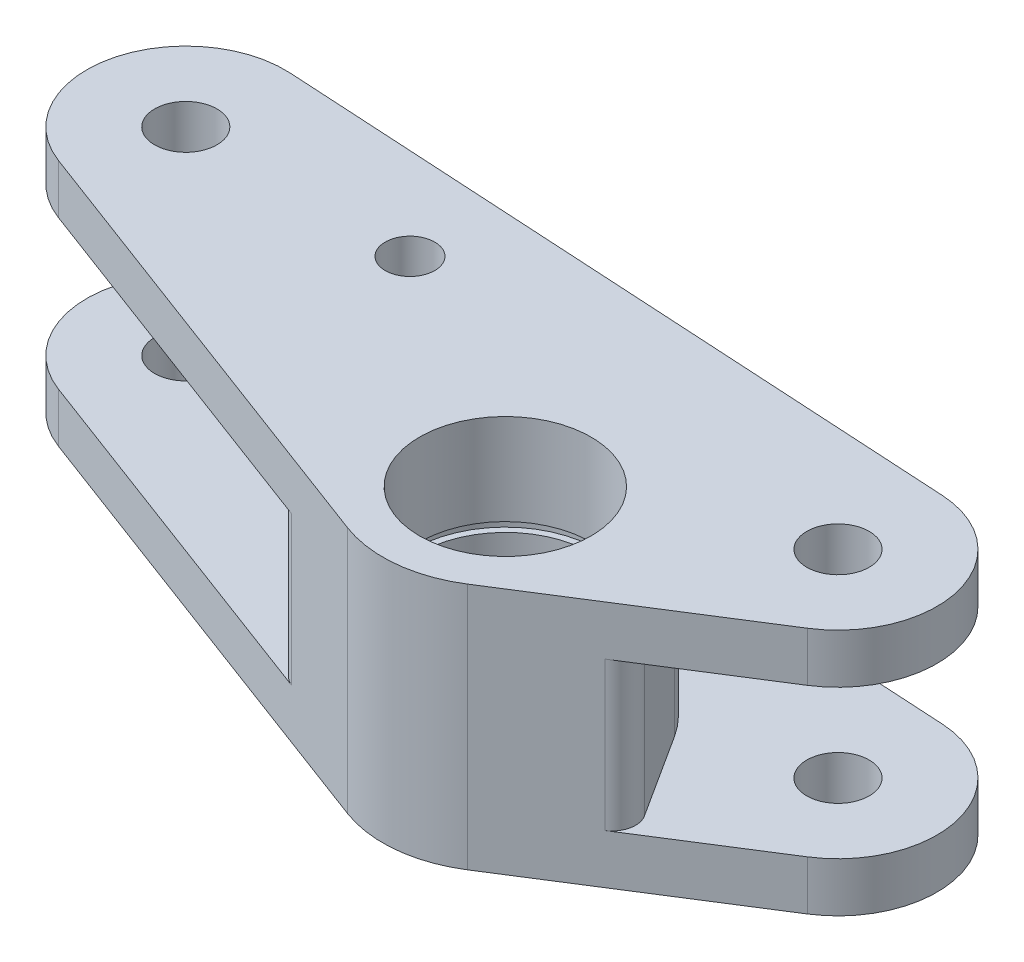
ISO-10303-21;
HEADER;
FILE_DESCRIPTION(('STEP AP214'),'2;1');
FILE_NAME('part.step','',(''),(''),'','','');
FILE_SCHEMA(('AUTOMOTIVE_DESIGN { 1 0 10303 214 1 1 1 1 }'));
ENDSEC;
DATA;
#1=APPLICATION_CONTEXT('core data for automotive mechanical design processes');
#2=APPLICATION_PROTOCOL_DEFINITION('international standard','automotive_design',2000,#1);
#3=PRODUCT_CONTEXT('',#1,'mechanical');
#4=PRODUCT('Part','Part','',(#3));
#5=PRODUCT_RELATED_PRODUCT_CATEGORY('part','',(#4));
#6=PRODUCT_DEFINITION_FORMATION('','',#4);
#7=PRODUCT_DEFINITION_CONTEXT('part definition',#1,'design');
#8=PRODUCT_DEFINITION('design','',#6,#7);
#9=PRODUCT_DEFINITION_SHAPE('','',#8);
#10=(LENGTH_UNIT() NAMED_UNIT(*) SI_UNIT(.MILLI.,.METRE.));
#11=(NAMED_UNIT(*) PLANE_ANGLE_UNIT() SI_UNIT($,.RADIAN.));
#12=(NAMED_UNIT(*) SI_UNIT($,.STERADIAN.) SOLID_ANGLE_UNIT());
#13=UNCERTAINTY_MEASURE_WITH_UNIT(LENGTH_MEASURE(1.E-05),#10,'distance_accuracy_value','');
#14=(GEOMETRIC_REPRESENTATION_CONTEXT(3) GLOBAL_UNCERTAINTY_ASSIGNED_CONTEXT((#13)) GLOBAL_UNIT_ASSIGNED_CONTEXT((#10,
#11,#12)) REPRESENTATION_CONTEXT('',''));
#15=CARTESIAN_POINT('',(0.,0.,0.));
#16=DIRECTION('',(0.,0.,1.));
#17=DIRECTION('',(1.,0.,0.));
#18=AXIS2_PLACEMENT_3D('',#15,#16,#17);
#19=CARTESIAN_POINT('',(81.6859148741198,-18.875,-15.7088297834846));
#20=DIRECTION('',(0.,1.,0.));
#21=DIRECTION('',(0.,0.,1.));
#22=AXIS2_PLACEMENT_3D('',#19,#20,#21);
#23=CYLINDRICAL_SURFACE('',#22,11.);
#24=CARTESIAN_POINT('',(81.6859148741198,-18.875,-15.7088297834846));
#25=DIRECTION('',(0.,1.,0.));
#26=DIRECTION('',(0.,0.,1.));
#27=AXIS2_PLACEMENT_3D('',#24,#25,#26);
#28=CIRCLE('',#27,11.);
#29=CARTESIAN_POINT('',(81.6859148741198,-18.875,-4.70882978348459));
#30=VERTEX_POINT('',#29);
#31=EDGE_CURVE('E238',#30,#30,#28,.T.);
#32=ORIENTED_EDGE('',*,*,#31,.F.);
#33=EDGE_LOOP('',(#32));
#34=FACE_BOUND('',#33,.T.);
#35=CARTESIAN_POINT('',(81.6859148741198,-12.875,-15.7088297834846));
#36=DIRECTION('',(0.,1.,0.));
#37=DIRECTION('',(0.,0.,1.));
#38=AXIS2_PLACEMENT_3D('',#35,#36,#37);
#39=CIRCLE('',#38,11.);
#40=CARTESIAN_POINT('',(81.6859148741198,-12.875,-4.70882978348459));
#41=VERTEX_POINT('',#40);
#42=EDGE_CURVE('E239',#41,#41,#39,.F.);
#43=ORIENTED_EDGE('',*,*,#42,.F.);
#44=EDGE_LOOP('',(#43));
#45=FACE_BOUND('',#44,.T.);
#46=ADVANCED_FACE('F47',(#34,#45),#23,.F.);
#47=CARTESIAN_POINT('',(81.6859148741198,-31.75,-15.7088297834846));
#48=DIRECTION('',(0.,1.,0.));
#49=DIRECTION('',(0.,0.,1.));
#50=AXIS2_PLACEMENT_3D('',#47,#48,#49);
#51=CYLINDRICAL_SURFACE('',#50,9.);
#52=CARTESIAN_POINT('',(81.6859148741198,-31.75,-15.7088297834846));
#53=DIRECTION('',(0.,1.,0.));
#54=DIRECTION('',(0.,0.,1.));
#55=AXIS2_PLACEMENT_3D('',#52,#53,#54);
#56=CIRCLE('',#55,9.);
#57=CARTESIAN_POINT('',(81.6859148741198,-31.75,-6.70882978348458));
#58=VERTEX_POINT('',#57);
#59=EDGE_CURVE('E433',#58,#58,#56,.T.);
#60=ORIENTED_EDGE('',*,*,#59,.F.);
#61=EDGE_LOOP('',(#60));
#62=FACE_BOUND('',#61,.T.);
#63=CARTESIAN_POINT('',(81.6859148741198,-18.875,-15.7088297834846));
#64=DIRECTION('',(0.,1.,0.));
#65=DIRECTION('',(0.,0.,1.));
#66=AXIS2_PLACEMENT_3D('',#63,#64,#65);
#67=CIRCLE('',#66,9.);
#68=CARTESIAN_POINT('',(81.6859148741198,-18.875,-6.70882978348458));
#69=VERTEX_POINT('',#68);
#70=EDGE_CURVE('E235',#69,#69,#67,.F.);
#71=ORIENTED_EDGE('',*,*,#70,.F.);
#72=EDGE_LOOP('',(#71));
#73=FACE_BOUND('',#72,.T.);
#74=ADVANCED_FACE('F465',(#62,#73),#51,.F.);
#75=CARTESIAN_POINT('',(2.81166810884834,-31.75,-48.9441522266959));
#76=DIRECTION('',(-0.0573519010143659,0.,0.998354025108347));
#77=DIRECTION('',(0.998354025108347,0.,0.0573519010143659));
#78=AXIS2_PLACEMENT_3D('',#75,#76,#77);
#79=PLANE('',#78);
#80=DIRECTION('',(-0.998354025108347,0.,-0.0573519010143659));
#81=VECTOR('',#80,1.);
#82=CARTESIAN_POINT('',(2.81166810884834,-25.4,-48.9441522266959));
#83=LINE('',#82,#81);
#84=CARTESIAN_POINT('',(110.733053141936,-25.4,-42.7444510825259));
#85=VERTEX_POINT('',#84);
#86=CARTESIAN_POINT('',(21.9682433490338,-25.4,-47.8436748616348));
#87=VERTEX_POINT('',#86);
#88=EDGE_CURVE('E416',#85,#87,#83,.T.);
#89=ORIENTED_EDGE('',*,*,#88,.F.);
#90=DIRECTION('',(0.,1.,0.));
#91=VECTOR('',#90,1.);
#92=CARTESIAN_POINT('',(110.733053141936,-31.75,-42.7444510825259));
#93=LINE('',#92,#91);
#94=CARTESIAN_POINT('',(110.733053141936,-31.75,-42.7444510825259));
#95=VERTEX_POINT('',#94);
#96=EDGE_CURVE('E214',#95,#85,#93,.T.);
#97=ORIENTED_EDGE('',*,*,#96,.F.);
#98=DIRECTION('',(0.998354025108347,0.,0.0573519010143659));
#99=VECTOR('',#98,1.);
#100=CARTESIAN_POINT('',(2.81166810884834,-31.75,-48.9441522266959));
#101=LINE('',#100,#99);
#102=CARTESIAN_POINT('',(21.9682433490338,-31.75,-47.8436748616348));
#103=VERTEX_POINT('',#102);
#104=EDGE_CURVE('E73',#103,#95,#101,.T.);
#105=ORIENTED_EDGE('',*,*,#104,.F.);
#106=DIRECTION('',(0.,1.,0.));
#107=VECTOR('',#106,1.);
#108=CARTESIAN_POINT('',(21.9682433490338,-31.75,-47.8436748616348));
#109=LINE('',#108,#107);
#110=EDGE_CURVE('E111',#103,#87,#109,.T.);
#111=ORIENTED_EDGE('',*,*,#110,.T.);
#112=EDGE_LOOP('',(#89,#97,#105,#111));
#113=FACE_BOUND('',#112,.T.);
#114=ADVANCED_FACE('F471',(#113),#79,.F.);
#115=CARTESIAN_POINT('',(110.004683999053,-31.75,-30.0653549636499));
#116=DIRECTION('',(0.,1.,0.));
#117=DIRECTION('',(0.,0.,1.));
#118=AXIS2_PLACEMENT_3D('',#115,#116,#117);
#119=CYLINDRICAL_SURFACE('',#118,12.7);
#120=ORIENTED_EDGE('',*,*,#96,.T.);
#121=CARTESIAN_POINT('',(110.004683999053,-25.4,-30.0653549636499));
#122=DIRECTION('',(0.,1.,0.));
#123=DIRECTION('',(0.,0.,1.));
#124=AXIS2_PLACEMENT_3D('',#121,#122,#123);
#125=CIRCLE('',#124,12.7);
#126=CARTESIAN_POINT('',(116.795312979301,-25.4,-19.3332834929308));
#127=VERTEX_POINT('',#126);
#128=EDGE_CURVE('E405',#85,#127,#125,.F.);
#129=ORIENTED_EDGE('',*,*,#128,.T.);
#130=DIRECTION('',(0.,1.,0.));
#131=VECTOR('',#130,1.);
#132=CARTESIAN_POINT('',(116.795312979301,-31.75,-19.3332834929308));
#133=LINE('',#132,#131);
#134=CARTESIAN_POINT('',(116.795312979301,-31.75,-19.3332834929308));
#135=VERTEX_POINT('',#134);
#136=EDGE_CURVE('E220',#135,#127,#133,.T.);
#137=ORIENTED_EDGE('',*,*,#136,.F.);
#138=CARTESIAN_POINT('',(110.004683999053,-31.75,-30.0653549636499));
#139=DIRECTION('',(0.,1.,0.));
#140=DIRECTION('',(0.,0.,1.));
#141=AXIS2_PLACEMENT_3D('',#138,#139,#140);
#142=CIRCLE('',#141,12.7);
#143=EDGE_CURVE('E143',#135,#95,#142,.T.);
#144=ORIENTED_EDGE('',*,*,#143,.T.);
#145=EDGE_LOOP('',(#120,#129,#137,#144));
#146=FACE_BOUND('',#145,.T.);
#147=ADVANCED_FACE('F414',(#146),#119,.T.);
#148=CARTESIAN_POINT('',(24.6560777494752,-31.75,38.9670514122725));
#149=DIRECTION('',(0.534695195295083,0.,0.845044997694414));
#150=DIRECTION('',(0.845044997694414,0.,-0.534695195295083));
#151=AXIS2_PLACEMENT_3D('',#148,#149,#150);
#152=PLANE('',#151);
#153=ORIENTED_EDGE('',*,*,#136,.T.);
#154=DIRECTION('',(-0.845044997694414,0.,0.534695195295083));
#155=VECTOR('',#154,1.);
#156=CARTESIAN_POINT('',(24.6560777494752,-25.4,38.9670514122725));
#157=LINE('',#156,#155);
#158=CARTESIAN_POINT('',(100.890869613598,-25.4,-9.26987920714016));
#159=VERTEX_POINT('',#158);
#160=EDGE_CURVE('E408',#127,#159,#157,.T.);
#161=ORIENTED_EDGE('',*,*,#160,.T.);
#162=DIRECTION('',(0.,-1.,0.));
#163=VECTOR('',#162,1.);
#164=CARTESIAN_POINT('',(100.890869613598,-31.75,-9.26987920714017));
#165=LINE('',#164,#163);
#166=CARTESIAN_POINT('',(100.890869613598,-6.35,-9.26987920714016));
#167=VERTEX_POINT('',#166);
#168=EDGE_CURVE('E12',#167,#159,#165,.T.);
#169=ORIENTED_EDGE('',*,*,#168,.F.);
#170=DIRECTION('',(-0.845044997694414,0.,0.534695195295083));
#171=VECTOR('',#170,1.);
#172=CARTESIAN_POINT('',(24.6560777494752,-6.35,38.9670514122725));
#173=LINE('',#172,#171);
#174=CARTESIAN_POINT('',(116.795312979301,-6.35,-19.3332834929308));
#175=VERTEX_POINT('',#174);
#176=EDGE_CURVE('E354',#175,#167,#173,.T.);
#177=ORIENTED_EDGE('',*,*,#176,.F.);
#178=CARTESIAN_POINT('',(116.795312979301,0.,-19.3332834929308));
#179=VERTEX_POINT('',#178);
#180=EDGE_CURVE('E134',#175,#179,#133,.T.);
#181=ORIENTED_EDGE('',*,*,#180,.T.);
#182=DIRECTION('',(0.845044997694414,0.,-0.534695195295083));
#183=VECTOR('',#182,1.);
#184=CARTESIAN_POINT('',(24.6560777494752,0.,38.9670514122725));
#185=LINE('',#184,#183);
#186=CARTESIAN_POINT('',(90.0859763922056,0.,-2.43317286970533));
#187=VERTEX_POINT('',#186);
#188=EDGE_CURVE('E129',#187,#179,#185,.T.);
#189=ORIENTED_EDGE('',*,*,#188,.F.);
#190=DIRECTION('',(0.,1.,0.));
#191=VECTOR('',#190,1.);
#192=CARTESIAN_POINT('',(90.0859763922056,-31.75,-2.43317286970533));
#193=LINE('',#192,#191);
#194=CARTESIAN_POINT('',(90.0859763922056,-31.75,-2.43317286970533));
#195=VERTEX_POINT('',#194);
#196=EDGE_CURVE('E123',#195,#187,#193,.T.);
#197=ORIENTED_EDGE('',*,*,#196,.F.);
#198=DIRECTION('',(0.845044997694414,0.,-0.534695195295083));
#199=VECTOR('',#198,1.);
#200=CARTESIAN_POINT('',(24.6560777494752,-31.75,38.9670514122725));
#201=LINE('',#200,#199);
#202=EDGE_CURVE('E127',#195,#135,#201,.T.);
#203=ORIENTED_EDGE('',*,*,#202,.T.);
#204=EDGE_LOOP('',(#153,#161,#169,#177,#181,#189,#197,#203));
#205=FACE_BOUND('',#204,.T.);
#206=ADVANCED_FACE('F126',(#205),#152,.T.);
#207=CARTESIAN_POINT('',(9.72163911281416,-31.75,-25.9206871471055));
#208=DIRECTION('',(-0.351167189513707,0.,0.936312770931298));
#209=DIRECTION('',(0.936312770931298,0.,0.351167189513707));
#210=AXIS2_PLACEMENT_3D('',#207,#208,#209);
#211=PLANE('',#210);
#212=DIRECTION('',(0.,1.,0.));
#213=VECTOR('',#212,1.);
#214=CARTESIAN_POINT('',(64.6448445045883,-31.75,-5.32155801493586));
#215=LINE('',#214,#213);
#216=CARTESIAN_POINT('',(64.6448445045899,-25.4,-5.32155801493533));
#217=VERTEX_POINT('',#216);
#218=CARTESIAN_POINT('',(64.6448445045899,-6.35,-5.32155801493533));
#219=VERTEX_POINT('',#218);
#220=EDGE_CURVE('E56',#217,#219,#215,.T.);
#221=ORIENTED_EDGE('',*,*,#220,.F.);
#222=DIRECTION('',(-0.936312770931298,0.,-0.351167189513707));
#223=VECTOR('',#222,1.);
#224=CARTESIAN_POINT('',(9.72163911281416,-25.4,-25.9206871471055));
#225=LINE('',#224,#223);
#226=CARTESIAN_POINT('',(16.7800508993272,-25.4,-23.2734065519313));
#227=VERTEX_POINT('',#226);
#228=EDGE_CURVE('E419',#217,#227,#225,.T.);
#229=ORIENTED_EDGE('',*,*,#228,.T.);
#230=DIRECTION('',(0.,1.,0.));
#231=VECTOR('',#230,1.);
#232=CARTESIAN_POINT('',(16.7800508993272,-31.75,-23.2734065519313));
#233=LINE('',#232,#231);
#234=CARTESIAN_POINT('',(16.7800508993272,-31.75,-23.2734065519313));
#235=VERTEX_POINT('',#234);
#236=EDGE_CURVE('E223',#235,#227,#233,.T.);
#237=ORIENTED_EDGE('',*,*,#236,.F.);
#238=DIRECTION('',(0.936312770931297,0.,0.351167189513707));
#239=VECTOR('',#238,1.);
#240=CARTESIAN_POINT('',(9.72163911281416,-31.75,-25.9206871471055));
#241=LINE('',#240,#239);
#242=CARTESIAN_POINT('',(76.1690783268595,-31.75,-0.999356152153907));
#243=VERTEX_POINT('',#242);
#244=EDGE_CURVE('E146',#235,#243,#241,.T.);
#245=ORIENTED_EDGE('',*,*,#244,.T.);
#246=DIRECTION('',(0.,1.,0.));
#247=VECTOR('',#246,1.);
#248=CARTESIAN_POINT('',(76.1690783268595,-31.75,-0.999356152153907));
#249=LINE('',#248,#247);
#250=CARTESIAN_POINT('',(76.1690783268595,0.,-0.999356152153907));
#251=VERTEX_POINT('',#250);
#252=EDGE_CURVE('E135',#243,#251,#249,.T.);
#253=ORIENTED_EDGE('',*,*,#252,.T.);
#254=DIRECTION('',(0.936312770931297,0.,0.351167189513707));
#255=VECTOR('',#254,1.);
#256=CARTESIAN_POINT('',(9.72163911281416,0.,-25.9206871471055));
#257=LINE('',#256,#255);
#258=CARTESIAN_POINT('',(16.7800508993272,0.,-23.2734065519313));
#259=VERTEX_POINT('',#258);
#260=EDGE_CURVE('E174',#259,#251,#257,.T.);
#261=ORIENTED_EDGE('',*,*,#260,.F.);
#262=CARTESIAN_POINT('',(16.7800508993272,-6.35,-23.2734065519313));
#263=VERTEX_POINT('',#262);
#264=EDGE_CURVE('E226',#263,#259,#233,.T.);
#265=ORIENTED_EDGE('',*,*,#264,.F.);
#266=DIRECTION('',(-0.936312770931298,0.,-0.351167189513707));
#267=VECTOR('',#266,1.);
#268=CARTESIAN_POINT('',(9.72163911281416,-6.35,-25.9206871471055));
#269=LINE('',#268,#267);
#270=EDGE_CURVE('E64',#219,#263,#269,.T.);
#271=ORIENTED_EDGE('',*,*,#270,.F.);
#272=EDGE_LOOP('',(#221,#229,#237,#245,#253,#261,#265,#271));
#273=FACE_BOUND('',#272,.T.);
#274=ADVANCED_FACE('F447',(#273),#211,.T.);
#275=CARTESIAN_POINT('',(21.2398742061513,-31.75,-35.1645787427588));
#276=DIRECTION('',(0.,1.,0.));
#277=DIRECTION('',(0.,0.,1.));
#278=AXIS2_PLACEMENT_3D('',#275,#276,#277);
#279=CYLINDRICAL_SURFACE('',#278,4.);
#280=CARTESIAN_POINT('',(21.2398742061513,-31.75,-35.1645787427588));
#281=DIRECTION('',(0.,1.,0.));
#282=DIRECTION('',(0.,0.,1.));
#283=AXIS2_PLACEMENT_3D('',#280,#281,#282);
#284=CIRCLE('',#283,4.);
#285=CARTESIAN_POINT('',(21.2398742061513,-31.75,-31.1645787427588));
#286=VERTEX_POINT('',#285);
#287=EDGE_CURVE('E189',#286,#286,#284,.T.);
#288=ORIENTED_EDGE('',*,*,#287,.F.);
#289=EDGE_LOOP('',(#288));
#290=FACE_BOUND('',#289,.T.);
#291=CARTESIAN_POINT('',(21.2398742061513,-25.4,-35.1645787427588));
#292=DIRECTION('',(0.,1.,0.));
#293=DIRECTION('',(0.,0.,1.));
#294=AXIS2_PLACEMENT_3D('',#291,#292,#293);
#295=CIRCLE('',#294,4.);
#296=CARTESIAN_POINT('',(21.2398742061513,-25.4,-31.1645787427588));
#297=VERTEX_POINT('',#296);
#298=EDGE_CURVE('E428',#297,#297,#295,.F.);
#299=ORIENTED_EDGE('',*,*,#298,.F.);
#300=EDGE_LOOP('',(#299));
#301=FACE_BOUND('',#300,.T.);
#302=ADVANCED_FACE('F443',(#290,#301),#279,.F.);
#303=CARTESIAN_POINT('',(110.004683999053,-31.75,-30.0653549636499));
#304=DIRECTION('',(0.,1.,0.));
#305=DIRECTION('',(0.,0.,1.));
#306=AXIS2_PLACEMENT_3D('',#303,#304,#305);
#307=CYLINDRICAL_SURFACE('',#306,4.00000000000001);
#308=CARTESIAN_POINT('',(110.004683999053,-31.75,-30.0653549636499));
#309=DIRECTION('',(0.,1.,0.));
#310=DIRECTION('',(0.,0.,1.));
#311=AXIS2_PLACEMENT_3D('',#308,#309,#310);
#312=CIRCLE('',#311,4.00000000000001);
#313=CARTESIAN_POINT('',(110.004683999053,-31.75,-26.0653549636499));
#314=VERTEX_POINT('',#313);
#315=EDGE_CURVE('E435',#314,#314,#312,.T.);
#316=ORIENTED_EDGE('',*,*,#315,.F.);
#317=EDGE_LOOP('',(#316));
#318=FACE_BOUND('',#317,.T.);
#319=CARTESIAN_POINT('',(110.004683999053,-25.4,-30.0653549636499));
#320=DIRECTION('',(0.,1.,0.));
#321=DIRECTION('',(0.,0.,1.));
#322=AXIS2_PLACEMENT_3D('',#319,#320,#321);
#323=CIRCLE('',#322,4.00000000000001);
#324=CARTESIAN_POINT('',(110.004683999053,-25.4,-26.0653549636499));
#325=VERTEX_POINT('',#324);
#326=EDGE_CURVE('E425',#325,#325,#323,.F.);
#327=ORIENTED_EDGE('',*,*,#326,.F.);
#328=EDGE_LOOP('',(#327));
#329=FACE_BOUND('',#328,.T.);
#330=ADVANCED_FACE('F446',(#318,#329),#307,.F.);
#331=CARTESIAN_POINT('',(50.,-31.75,-35.1645787427588));
#332=DIRECTION('',(0.,1.,0.));
#333=DIRECTION('',(0.,0.,1.));
#334=AXIS2_PLACEMENT_3D('',#331,#332,#333);
#335=CYLINDRICAL_SURFACE('',#334,3.175);
#336=CARTESIAN_POINT('',(50.,-31.75,-35.1645787427588));
#337=DIRECTION('',(0.,1.,0.));
#338=DIRECTION('',(0.,0.,1.));
#339=AXIS2_PLACEMENT_3D('',#336,#337,#338);
#340=CIRCLE('',#339,3.175);
#341=CARTESIAN_POINT('',(50.,-31.75,-31.9895787427588));
#342=VERTEX_POINT('',#341);
#343=EDGE_CURVE('E213',#342,#342,#340,.T.);
#344=ORIENTED_EDGE('',*,*,#343,.F.);
#345=EDGE_LOOP('',(#344));
#346=FACE_BOUND('',#345,.T.);
#347=CARTESIAN_POINT('',(50.,-25.4,-35.1645787427588));
#348=DIRECTION('',(0.,1.,0.));
#349=DIRECTION('',(0.,0.,1.));
#350=AXIS2_PLACEMENT_3D('',#347,#348,#349);
#351=CIRCLE('',#350,3.175);
#352=CARTESIAN_POINT('',(50.,-25.4,-31.9895787427588));
#353=VERTEX_POINT('',#352);
#354=EDGE_CURVE('E411',#353,#353,#351,.F.);
#355=ORIENTED_EDGE('',*,*,#354,.F.);
#356=EDGE_LOOP('',(#355));
#357=FACE_BOUND('',#356,.T.);
#358=ADVANCED_FACE('F545',(#346,#357),#335,.F.);
#359=CARTESIAN_POINT('',(21.2398742061513,-31.75,-35.1645787427588));
#360=DIRECTION('',(0.,1.,0.));
#361=DIRECTION('',(0.,0.,1.));
#362=AXIS2_PLACEMENT_3D('',#359,#360,#361);
#363=CYLINDRICAL_SURFACE('',#362,12.7);
#364=ORIENTED_EDGE('',*,*,#236,.T.);
#365=CARTESIAN_POINT('',(21.2398742061513,-25.4,-35.1645787427588));
#366=DIRECTION('',(0.,1.,0.));
#367=DIRECTION('',(0.,0.,1.));
#368=AXIS2_PLACEMENT_3D('',#365,#366,#367);
#369=CIRCLE('',#368,12.7);
#370=EDGE_CURVE('E230',#227,#87,#369,.F.);
#371=ORIENTED_EDGE('',*,*,#370,.T.);
#372=ORIENTED_EDGE('',*,*,#110,.F.);
#373=CARTESIAN_POINT('',(21.2398742061513,-31.75,-35.1645787427588));
#374=DIRECTION('',(0.,1.,0.));
#375=DIRECTION('',(0.,0.,1.));
#376=AXIS2_PLACEMENT_3D('',#373,#374,#375);
#377=CIRCLE('',#376,12.7);
#378=EDGE_CURVE('E148',#103,#235,#377,.T.);
#379=ORIENTED_EDGE('',*,*,#378,.T.);
#380=EDGE_LOOP('',(#364,#371,#372,#379));
#381=FACE_BOUND('',#380,.T.);
#382=ADVANCED_FACE('F530',(#381),#363,.T.);
#383=CARTESIAN_POINT('',(110.733053141936,-6.35,-42.7444510825259));
#384=VERTEX_POINT('',#383);
#385=CARTESIAN_POINT('',(110.733053141936,0.,-42.7444510825259));
#386=VERTEX_POINT('',#385);
#387=EDGE_CURVE('E102',#384,#386,#93,.T.);
#388=ORIENTED_EDGE('',*,*,#387,.F.);
#389=DIRECTION('',(-0.998354025108347,0.,-0.0573519010143659));
#390=VECTOR('',#389,1.);
#391=CARTESIAN_POINT('',(2.81166810884834,-6.35,-48.9441522266959));
#392=LINE('',#391,#390);
#393=CARTESIAN_POINT('',(21.9682433490338,-6.35,-47.8436748616348));
#394=VERTEX_POINT('',#393);
#395=EDGE_CURVE('E196',#384,#394,#392,.T.);
#396=ORIENTED_EDGE('',*,*,#395,.T.);
#397=CARTESIAN_POINT('',(21.9682433490338,0.,-47.8436748616348));
#398=VERTEX_POINT('',#397);
#399=EDGE_CURVE('E155',#394,#398,#109,.T.);
#400=ORIENTED_EDGE('',*,*,#399,.T.);
#401=DIRECTION('',(0.998354025108347,0.,0.0573519010143659));
#402=VECTOR('',#401,1.);
#403=CARTESIAN_POINT('',(2.81166810884834,0.,-48.9441522266959));
#404=LINE('',#403,#402);
#405=EDGE_CURVE('E175',#398,#386,#404,.T.);
#406=ORIENTED_EDGE('',*,*,#405,.T.);
#407=EDGE_LOOP('',(#388,#396,#400,#406));
#408=FACE_BOUND('',#407,.T.);
#409=ADVANCED_FACE('F534',(#408),#79,.F.);
#410=CARTESIAN_POINT('',(110.004683999053,-6.35,-30.0653549636499));
#411=DIRECTION('',(0.,1.,0.));
#412=DIRECTION('',(0.,0.,1.));
#413=AXIS2_PLACEMENT_3D('',#410,#411,#412);
#414=CIRCLE('',#413,12.7);
#415=EDGE_CURVE('E202',#384,#175,#414,.F.);
#416=ORIENTED_EDGE('',*,*,#415,.F.);
#417=ORIENTED_EDGE('',*,*,#387,.T.);
#418=CARTESIAN_POINT('',(110.004683999053,0.,-30.0653549636499));
#419=DIRECTION('',(0.,1.,0.));
#420=DIRECTION('',(0.,0.,1.));
#421=AXIS2_PLACEMENT_3D('',#418,#419,#420);
#422=CIRCLE('',#421,12.7);
#423=EDGE_CURVE('E207',#179,#386,#422,.T.);
#424=ORIENTED_EDGE('',*,*,#423,.F.);
#425=ORIENTED_EDGE('',*,*,#180,.F.);
#426=EDGE_LOOP('',(#416,#417,#424,#425));
#427=FACE_BOUND('',#426,.T.);
#428=ADVANCED_FACE('F517',(#427),#119,.T.);
#429=CARTESIAN_POINT('',(81.6859148741198,-31.75,-15.7088297834846));
#430=DIRECTION('',(0.,1.,0.));
#431=DIRECTION('',(0.,0.,1.));
#432=AXIS2_PLACEMENT_3D('',#429,#430,#431);
#433=CYLINDRICAL_SURFACE('',#432,15.71);
#434=CARTESIAN_POINT('',(81.6859148741198,0.,-15.7088297834846));
#435=DIRECTION('',(0.,1.,0.));
#436=DIRECTION('',(0.,0.,1.));
#437=AXIS2_PLACEMENT_3D('',#434,#435,#436);
#438=CIRCLE('',#437,15.71);
#439=EDGE_CURVE('E515',#251,#187,#438,.T.);
#440=ORIENTED_EDGE('',*,*,#439,.F.);
#441=ORIENTED_EDGE('',*,*,#252,.F.);
#442=CARTESIAN_POINT('',(81.6859148741198,-31.75,-15.7088297834846));
#443=DIRECTION('',(0.,1.,0.));
#444=DIRECTION('',(0.,0.,1.));
#445=AXIS2_PLACEMENT_3D('',#442,#443,#444);
#446=CIRCLE('',#445,15.71);
#447=EDGE_CURVE('E140',#243,#195,#446,.T.);
#448=ORIENTED_EDGE('',*,*,#447,.T.);
#449=ORIENTED_EDGE('',*,*,#196,.T.);
#450=EDGE_LOOP('',(#440,#441,#448,#449));
#451=FACE_BOUND('',#450,.T.);
#452=ADVANCED_FACE('F145',(#451),#433,.T.);
#453=CARTESIAN_POINT('',(21.2398742061513,-6.35,-35.1645787427588));
#454=DIRECTION('',(0.,1.,0.));
#455=DIRECTION('',(0.,0.,1.));
#456=AXIS2_PLACEMENT_3D('',#453,#454,#455);
#457=CIRCLE('',#456,4.);
#458=CARTESIAN_POINT('',(21.2398742061513,-6.35,-31.1645787427588));
#459=VERTEX_POINT('',#458);
#460=EDGE_CURVE('E526',#459,#459,#457,.F.);
#461=ORIENTED_EDGE('',*,*,#460,.T.);
#462=EDGE_LOOP('',(#461));
#463=FACE_BOUND('',#462,.T.);
#464=CARTESIAN_POINT('',(21.2398742061513,0.,-35.1645787427588));
#465=DIRECTION('',(0.,1.,0.));
#466=DIRECTION('',(0.,0.,1.));
#467=AXIS2_PLACEMENT_3D('',#464,#465,#466);
#468=CIRCLE('',#467,4.);
#469=CARTESIAN_POINT('',(21.2398742061513,0.,-31.1645787427588));
#470=VERTEX_POINT('',#469);
#471=EDGE_CURVE('E502',#470,#470,#468,.T.);
#472=ORIENTED_EDGE('',*,*,#471,.T.);
#473=EDGE_LOOP('',(#472));
#474=FACE_BOUND('',#473,.T.);
#475=ADVANCED_FACE('F449',(#463,#474),#279,.F.);
#476=CARTESIAN_POINT('',(110.004683999053,-6.35,-30.0653549636499));
#477=DIRECTION('',(0.,1.,0.));
#478=DIRECTION('',(0.,0.,1.));
#479=AXIS2_PLACEMENT_3D('',#476,#477,#478);
#480=CIRCLE('',#479,4.00000000000001);
#481=CARTESIAN_POINT('',(110.004683999053,-6.35,-26.0653549636499));
#482=VERTEX_POINT('',#481);
#483=EDGE_CURVE('E520',#482,#482,#480,.F.);
#484=ORIENTED_EDGE('',*,*,#483,.T.);
#485=EDGE_LOOP('',(#484));
#486=FACE_BOUND('',#485,.T.);
#487=CARTESIAN_POINT('',(110.004683999053,0.,-30.0653549636499));
#488=DIRECTION('',(0.,1.,0.));
#489=DIRECTION('',(0.,0.,1.));
#490=AXIS2_PLACEMENT_3D('',#487,#488,#489);
#491=CIRCLE('',#490,4.00000000000001);
#492=CARTESIAN_POINT('',(110.004683999053,0.,-26.0653549636499));
#493=VERTEX_POINT('',#492);
#494=EDGE_CURVE('E498',#493,#493,#491,.T.);
#495=ORIENTED_EDGE('',*,*,#494,.T.);
#496=EDGE_LOOP('',(#495));
#497=FACE_BOUND('',#496,.T.);
#498=ADVANCED_FACE('F558',(#486,#497),#307,.F.);
#499=CARTESIAN_POINT('',(50.,-6.35,-35.1645787427588));
#500=DIRECTION('',(0.,1.,0.));
#501=DIRECTION('',(0.,0.,1.));
#502=AXIS2_PLACEMENT_3D('',#499,#500,#501);
#503=CIRCLE('',#502,3.175);
#504=CARTESIAN_POINT('',(50.,-6.35,-31.9895787427588));
#505=VERTEX_POINT('',#504);
#506=EDGE_CURVE('E518',#505,#505,#503,.F.);
#507=ORIENTED_EDGE('',*,*,#506,.T.);
#508=EDGE_LOOP('',(#507));
#509=FACE_BOUND('',#508,.T.);
#510=CARTESIAN_POINT('',(50.,0.,-35.1645787427588));
#511=DIRECTION('',(0.,1.,0.));
#512=DIRECTION('',(0.,0.,1.));
#513=AXIS2_PLACEMENT_3D('',#510,#511,#512);
#514=CIRCLE('',#513,3.175);
#515=CARTESIAN_POINT('',(50.,0.,-31.9895787427588));
#516=VERTEX_POINT('',#515);
#517=EDGE_CURVE('E156',#516,#516,#514,.T.);
#518=ORIENTED_EDGE('',*,*,#517,.T.);
#519=EDGE_LOOP('',(#518));
#520=FACE_BOUND('',#519,.T.);
#521=ADVANCED_FACE('F49',(#509,#520),#335,.F.);
#522=ORIENTED_EDGE('',*,*,#399,.F.);
#523=CARTESIAN_POINT('',(21.2398742061513,-6.35,-35.1645787427588));
#524=DIRECTION('',(0.,1.,0.));
#525=DIRECTION('',(0.,0.,1.));
#526=AXIS2_PLACEMENT_3D('',#523,#524,#525);
#527=CIRCLE('',#526,12.7);
#528=EDGE_CURVE('E219',#263,#394,#527,.F.);
#529=ORIENTED_EDGE('',*,*,#528,.F.);
#530=ORIENTED_EDGE('',*,*,#264,.T.);
#531=CARTESIAN_POINT('',(21.2398742061513,0.,-35.1645787427588));
#532=DIRECTION('',(0.,1.,0.));
#533=DIRECTION('',(0.,0.,1.));
#534=AXIS2_PLACEMENT_3D('',#531,#532,#533);
#535=CIRCLE('',#534,12.7);
#536=EDGE_CURVE('E169',#398,#259,#535,.T.);
#537=ORIENTED_EDGE('',*,*,#536,.F.);
#538=EDGE_LOOP('',(#522,#529,#530,#537));
#539=FACE_BOUND('',#538,.T.);
#540=ADVANCED_FACE('F510',(#539),#363,.T.);
#541=CARTESIAN_POINT('',(0.,-31.75,0.));
#542=DIRECTION('',(0.,1.,0.));
#543=DIRECTION('',(0.,0.,1.));
#544=AXIS2_PLACEMENT_3D('',#541,#542,#543);
#545=PLANE('',#544);
#546=ORIENTED_EDGE('',*,*,#343,.T.);
#547=EDGE_LOOP('',(#546));
#548=FACE_BOUND('',#547,.T.);
#549=ORIENTED_EDGE('',*,*,#59,.T.);
#550=EDGE_LOOP('',(#549));
#551=FACE_BOUND('',#550,.T.);
#552=ORIENTED_EDGE('',*,*,#315,.T.);
#553=EDGE_LOOP('',(#552));
#554=FACE_BOUND('',#553,.T.);
#555=ORIENTED_EDGE('',*,*,#287,.T.);
#556=EDGE_LOOP('',(#555));
#557=FACE_BOUND('',#556,.T.);
#558=ORIENTED_EDGE('',*,*,#104,.T.);
#559=ORIENTED_EDGE('',*,*,#143,.F.);
#560=ORIENTED_EDGE('',*,*,#202,.F.);
#561=ORIENTED_EDGE('',*,*,#447,.F.);
#562=ORIENTED_EDGE('',*,*,#244,.F.);
#563=ORIENTED_EDGE('',*,*,#378,.F.);
#564=EDGE_LOOP('',(#558,#559,#560,#561,#562,#563));
#565=FACE_BOUND('',#564,.T.);
#566=ADVANCED_FACE('F138',(#548,#551,#554,#557,#565),#545,.F.);
#567=CARTESIAN_POINT('',(0.,0.,0.));
#568=DIRECTION('',(0.,1.,0.));
#569=DIRECTION('',(0.,0.,1.));
#570=AXIS2_PLACEMENT_3D('',#567,#568,#569);
#571=PLANE('',#570);
#572=CARTESIAN_POINT('',(81.6859148741198,0.,-15.7088297834846));
#573=DIRECTION('',(0.,1.,0.));
#574=DIRECTION('',(0.,0.,1.));
#575=AXIS2_PLACEMENT_3D('',#572,#573,#574);
#576=CIRCLE('',#575,11.);
#577=CARTESIAN_POINT('',(81.6859148741198,0.,-4.70882978348459));
#578=VERTEX_POINT('',#577);
#579=EDGE_CURVE('E245',#578,#578,#576,.T.);
#580=ORIENTED_EDGE('',*,*,#579,.F.);
#581=EDGE_LOOP('',(#580));
#582=FACE_BOUND('',#581,.T.);
#583=ORIENTED_EDGE('',*,*,#517,.F.);
#584=EDGE_LOOP('',(#583));
#585=FACE_BOUND('',#584,.T.);
#586=ORIENTED_EDGE('',*,*,#494,.F.);
#587=EDGE_LOOP('',(#586));
#588=FACE_BOUND('',#587,.T.);
#589=ORIENTED_EDGE('',*,*,#471,.F.);
#590=EDGE_LOOP('',(#589));
#591=FACE_BOUND('',#590,.T.);
#592=ORIENTED_EDGE('',*,*,#405,.F.);
#593=ORIENTED_EDGE('',*,*,#536,.T.);
#594=ORIENTED_EDGE('',*,*,#260,.T.);
#595=ORIENTED_EDGE('',*,*,#439,.T.);
#596=ORIENTED_EDGE('',*,*,#188,.T.);
#597=ORIENTED_EDGE('',*,*,#423,.T.);
#598=EDGE_LOOP('',(#592,#593,#594,#595,#596,#597));
#599=FACE_BOUND('',#598,.T.);
#600=ADVANCED_FACE('F453',(#582,#585,#588,#591,#599),#571,.T.);
#601=CARTESIAN_POINT('',(99.2855746117034,-25.4,-11.8050735875522));
#602=DIRECTION('',(0.,1.,0.));
#603=DIRECTION('',(0.,0.,1.));
#604=AXIS2_PLACEMENT_3D('',#601,#602,#603);
#605=PLANE('',#604);
#606=ORIENTED_EDGE('',*,*,#128,.F.);
#607=ORIENTED_EDGE('',*,*,#88,.T.);
#608=ORIENTED_EDGE('',*,*,#370,.F.);
#609=ORIENTED_EDGE('',*,*,#228,.F.);
#610=DIRECTION('',(0.963188915231911,0.,0.268825433272923));
#611=VECTOR('',#610,1.);
#612=CARTESIAN_POINT('',(64.646726927578,-25.4,-5.32103263183831));
#613=LINE('',#612,#611);
#614=CARTESIAN_POINT('',(64.646726927578,-25.4,-5.32103263183831));
#615=VERTEX_POINT('',#614);
#616=EDGE_CURVE('E265',#217,#615,#613,.T.);
#617=ORIENTED_EDGE('',*,*,#616,.T.);
#618=CARTESIAN_POINT('',(65.7,-25.4,-8.13005663225387));
#619=DIRECTION('',(0.,-1.,0.));
#620=DIRECTION('',(0.,0.,-1.));
#621=AXIS2_PLACEMENT_3D('',#618,#619,#620);
#622=CIRCLE('',#621,3.);
#623=CARTESIAN_POINT('',(62.7,-25.4,-8.13005663225388));
#624=VERTEX_POINT('',#623);
#625=EDGE_CURVE('E268',#615,#624,#622,.T.);
#626=ORIENTED_EDGE('',*,*,#625,.T.);
#627=DIRECTION('',(0.,0.,-1.));
#628=VECTOR('',#627,1.);
#629=CARTESIAN_POINT('',(62.7,-25.4,-18.708063959497));
#630=LINE('',#629,#628);
#631=CARTESIAN_POINT('',(62.7,-25.4,-18.708063959497));
#632=VERTEX_POINT('',#631);
#633=EDGE_CURVE('E271',#624,#632,#630,.T.);
#634=ORIENTED_EDGE('',*,*,#633,.T.);
#635=CARTESIAN_POINT('',(65.7,-25.4,-18.708063959497));
#636=DIRECTION('',(0.,-1.,0.));
#637=DIRECTION('',(0.,0.,1.));
#638=AXIS2_PLACEMENT_3D('',#635,#636,#637);
#639=CIRCLE('',#638,3.);
#640=CARTESIAN_POINT('',(63.7413282789965,-25.4,-20.9804206853086));
#641=VERTEX_POINT('',#640);
#642=EDGE_CURVE('E274',#632,#641,#639,.T.);
#643=ORIENTED_EDGE('',*,*,#642,.T.);
#644=DIRECTION('',(0.757452241937194,0.,-0.652890573667838));
#645=VECTOR('',#644,1.);
#646=CARTESIAN_POINT('',(71.4297679851302,-25.4,-27.6075181211947));
#647=LINE('',#646,#645);
#648=CARTESIAN_POINT('',(71.4297679851302,-25.4,-27.6075181211947));
#649=VERTEX_POINT('',#648);
#650=EDGE_CURVE('E277',#641,#649,#647,.T.);
#651=ORIENTED_EDGE('',*,*,#650,.T.);
#652=CARTESIAN_POINT('',(81.6859148741198,-25.4,-15.7088297834846));
#653=DIRECTION('',(0.,-1.,0.));
#654=DIRECTION('',(0.,0.,1.));
#655=AXIS2_PLACEMENT_3D('',#652,#653,#654);
#656=CIRCLE('',#655,15.7088297834846);
#657=CARTESIAN_POINT('',(94.9100342120375,-25.4,-24.1876269212279));
#658=VERTEX_POINT('',#657);
#659=EDGE_CURVE('E280',#649,#658,#656,.T.);
#660=ORIENTED_EDGE('',*,*,#659,.T.);
#661=DIRECTION('',(0.539747215712843,0.,0.841827145636344));
#662=VECTOR('',#661,1.);
#663=CARTESIAN_POINT('',(94.9100342120375,-25.4,-24.1876269212279));
#664=LINE('',#663,#662);
#665=CARTESIAN_POINT('',(101.811056048612,-25.4,-13.4243152346908));
#666=VERTEX_POINT('',#665);
#667=EDGE_CURVE('E283',#658,#666,#664,.T.);
#668=ORIENTED_EDGE('',*,*,#667,.T.);
#669=CARTESIAN_POINT('',(99.2855746117034,-25.4,-11.8050735875522));
#670=DIRECTION('',(0.,-1.,0.));
#671=DIRECTION('',(0.,0.,1.));
#672=AXIS2_PLACEMENT_3D('',#669,#670,#671);
#673=CIRCLE('',#672,3.);
#674=CARTESIAN_POINT('',(100.889566336597,-25.4,-9.26987920714017));
#675=VERTEX_POINT('',#674);
#676=EDGE_CURVE('E258',#666,#675,#673,.T.);
#677=ORIENTED_EDGE('',*,*,#676,.T.);
#678=DIRECTION('',(1.,0.,0.));
#679=VECTOR('',#678,1.);
#680=CARTESIAN_POINT('',(124.896489338975,-25.4,-9.26987920714017));
#681=LINE('',#680,#679);
#682=EDGE_CURVE('E261',#675,#159,#681,.T.);
#683=ORIENTED_EDGE('',*,*,#682,.T.);
#684=ORIENTED_EDGE('',*,*,#160,.F.);
#685=EDGE_LOOP('',(#606,#607,#608,#609,#617,#626,#634,#643,#651,#660,#668,#677,#683,#684));
#686=FACE_BOUND('',#685,.T.);
#687=ORIENTED_EDGE('',*,*,#354,.T.);
#688=EDGE_LOOP('',(#687));
#689=FACE_BOUND('',#688,.T.);
#690=ORIENTED_EDGE('',*,*,#326,.T.);
#691=EDGE_LOOP('',(#690));
#692=FACE_BOUND('',#691,.T.);
#693=ORIENTED_EDGE('',*,*,#298,.T.);
#694=EDGE_LOOP('',(#693));
#695=FACE_BOUND('',#694,.T.);
#696=ADVANCED_FACE('F409',(#686,#689,#692,#695),#605,.T.);
#697=CARTESIAN_POINT('',(99.2855746117034,-6.35,-11.8050735875522));
#698=DIRECTION('',(0.,1.,0.));
#699=DIRECTION('',(0.,0.,1.));
#700=AXIS2_PLACEMENT_3D('',#697,#698,#699);
#701=PLANE('',#700);
#702=ORIENTED_EDGE('',*,*,#483,.F.);
#703=EDGE_LOOP('',(#702));
#704=FACE_BOUND('',#703,.T.);
#705=ORIENTED_EDGE('',*,*,#176,.T.);
#706=DIRECTION('',(1.,0.,0.));
#707=VECTOR('',#706,1.);
#708=CARTESIAN_POINT('',(124.896489338975,-6.35,-9.26987920714017));
#709=LINE('',#708,#707);
#710=CARTESIAN_POINT('',(100.889566336597,-6.35,-9.26987920714017));
#711=VERTEX_POINT('',#710);
#712=EDGE_CURVE('E289',#711,#167,#709,.T.);
#713=ORIENTED_EDGE('',*,*,#712,.F.);
#714=CARTESIAN_POINT('',(99.2855746117034,-6.35,-11.8050735875522));
#715=DIRECTION('',(0.,-1.,0.));
#716=DIRECTION('',(0.,0.,1.));
#717=AXIS2_PLACEMENT_3D('',#714,#715,#716);
#718=CIRCLE('',#717,3.);
#719=CARTESIAN_POINT('',(101.811056048612,-6.35,-13.4243152346908));
#720=VERTEX_POINT('',#719);
#721=EDGE_CURVE('E237',#720,#711,#718,.T.);
#722=ORIENTED_EDGE('',*,*,#721,.F.);
#723=DIRECTION('',(0.539747215712843,0.,0.841827145636344));
#724=VECTOR('',#723,1.);
#725=CARTESIAN_POINT('',(94.9100342120375,-6.35,-24.1876269212279));
#726=LINE('',#725,#724);
#727=CARTESIAN_POINT('',(94.9100342120375,-6.35,-24.1876269212279));
#728=VERTEX_POINT('',#727);
#729=EDGE_CURVE('E262',#728,#720,#726,.T.);
#730=ORIENTED_EDGE('',*,*,#729,.F.);
#731=CARTESIAN_POINT('',(81.6859148741198,-6.35,-15.7088297834846));
#732=DIRECTION('',(0.,-1.,0.));
#733=DIRECTION('',(0.,0.,1.));
#734=AXIS2_PLACEMENT_3D('',#731,#732,#733);
#735=CIRCLE('',#734,15.7088297834846);
#736=CARTESIAN_POINT('',(71.4297679851302,-6.35,-27.6075181211947));
#737=VERTEX_POINT('',#736);
#738=EDGE_CURVE('E307',#737,#728,#735,.T.);
#739=ORIENTED_EDGE('',*,*,#738,.F.);
#740=DIRECTION('',(0.757452241937194,0.,-0.652890573667838));
#741=VECTOR('',#740,1.);
#742=CARTESIAN_POINT('',(71.4297679851302,-6.35,-27.6075181211947));
#743=LINE('',#742,#741);
#744=CARTESIAN_POINT('',(63.7413282789965,-6.35,-20.9804206853086));
#745=VERTEX_POINT('',#744);
#746=EDGE_CURVE('E304',#745,#737,#743,.T.);
#747=ORIENTED_EDGE('',*,*,#746,.F.);
#748=CARTESIAN_POINT('',(65.7,-6.35,-18.708063959497));
#749=DIRECTION('',(0.,-1.,0.));
#750=DIRECTION('',(0.,0.,1.));
#751=AXIS2_PLACEMENT_3D('',#748,#749,#750);
#752=CIRCLE('',#751,3.);
#753=CARTESIAN_POINT('',(62.7,-6.35,-18.708063959497));
#754=VERTEX_POINT('',#753);
#755=EDGE_CURVE('E301',#754,#745,#752,.T.);
#756=ORIENTED_EDGE('',*,*,#755,.F.);
#757=DIRECTION('',(0.,0.,-1.));
#758=VECTOR('',#757,1.);
#759=CARTESIAN_POINT('',(62.7,-6.35,-18.708063959497));
#760=LINE('',#759,#758);
#761=CARTESIAN_POINT('',(62.7,-6.35,-8.13005663225388));
#762=VERTEX_POINT('',#761);
#763=EDGE_CURVE('E298',#762,#754,#760,.T.);
#764=ORIENTED_EDGE('',*,*,#763,.F.);
#765=CARTESIAN_POINT('',(65.7,-6.35,-8.13005663225387));
#766=DIRECTION('',(0.,-1.,0.));
#767=DIRECTION('',(0.,0.,-1.));
#768=AXIS2_PLACEMENT_3D('',#765,#766,#767);
#769=CIRCLE('',#768,3.);
#770=CARTESIAN_POINT('',(64.646726927578,-6.35,-5.32103263183831));
#771=VERTEX_POINT('',#770);
#772=EDGE_CURVE('E295',#771,#762,#769,.T.);
#773=ORIENTED_EDGE('',*,*,#772,.F.);
#774=DIRECTION('',(0.963188915231911,0.,0.268825433272923));
#775=VECTOR('',#774,1.);
#776=CARTESIAN_POINT('',(64.646726927578,-6.35,-5.32103263183831));
#777=LINE('',#776,#775);
#778=EDGE_CURVE('E292',#219,#771,#777,.T.);
#779=ORIENTED_EDGE('',*,*,#778,.F.);
#780=ORIENTED_EDGE('',*,*,#270,.T.);
#781=ORIENTED_EDGE('',*,*,#528,.T.);
#782=ORIENTED_EDGE('',*,*,#395,.F.);
#783=ORIENTED_EDGE('',*,*,#415,.T.);
#784=EDGE_LOOP('',(#705,#713,#722,#730,#739,#747,#756,#764,#773,#779,#780,#781,#782,#783));
#785=FACE_BOUND('',#784,.T.);
#786=ORIENTED_EDGE('',*,*,#506,.F.);
#787=EDGE_LOOP('',(#786));
#788=FACE_BOUND('',#787,.T.);
#789=ORIENTED_EDGE('',*,*,#460,.F.);
#790=EDGE_LOOP('',(#789));
#791=FACE_BOUND('',#790,.T.);
#792=ADVANCED_FACE('F348',(#704,#785,#788,#791),#701,.F.);
#793=CARTESIAN_POINT('',(99.2855746117034,-25.4,-11.8050735875522));
#794=DIRECTION('',(0.,1.,0.));
#795=DIRECTION('',(0.,0.,1.));
#796=AXIS2_PLACEMENT_3D('',#793,#794,#795);
#797=CYLINDRICAL_SURFACE('',#796,3.);
#798=ORIENTED_EDGE('',*,*,#721,.T.);
#799=DIRECTION('',(0.,1.,0.));
#800=VECTOR('',#799,1.);
#801=CARTESIAN_POINT('',(100.889566336597,-25.4,-9.26987920714017));
#802=LINE('',#801,#800);
#803=EDGE_CURVE('E286',#675,#711,#802,.T.);
#804=ORIENTED_EDGE('',*,*,#803,.F.);
#805=ORIENTED_EDGE('',*,*,#676,.F.);
#806=DIRECTION('',(0.,1.,0.));
#807=VECTOR('',#806,1.);
#808=CARTESIAN_POINT('',(101.811056048612,-25.4,-13.4243152346908));
#809=LINE('',#808,#807);
#810=EDGE_CURVE('E312',#666,#720,#809,.T.);
#811=ORIENTED_EDGE('',*,*,#810,.T.);
#812=EDGE_LOOP('',(#798,#804,#805,#811));
#813=FACE_BOUND('',#812,.T.);
#814=ADVANCED_FACE('F355',(#813),#797,.T.);
#815=CARTESIAN_POINT('',(94.9100342120375,-25.4,-24.1876269212279));
#816=DIRECTION('',(-0.841827145636344,0.,0.539747215712843));
#817=DIRECTION('',(0.539747215712843,0.,0.841827145636344));
#818=AXIS2_PLACEMENT_3D('',#815,#816,#817);
#819=PLANE('',#818);
#820=ORIENTED_EDGE('',*,*,#729,.T.);
#821=ORIENTED_EDGE('',*,*,#810,.F.);
#822=ORIENTED_EDGE('',*,*,#667,.F.);
#823=DIRECTION('',(0.,1.,0.));
#824=VECTOR('',#823,1.);
#825=CARTESIAN_POINT('',(94.9100342120375,-25.4,-24.1876269212279));
#826=LINE('',#825,#824);
#827=EDGE_CURVE('E315',#658,#728,#826,.T.);
#828=ORIENTED_EDGE('',*,*,#827,.T.);
#829=EDGE_LOOP('',(#820,#821,#822,#828));
#830=FACE_BOUND('',#829,.T.);
#831=ADVANCED_FACE('F362',(#830),#819,.F.);
#832=CARTESIAN_POINT('',(81.6859148741198,-25.4,-15.7088297834846));
#833=DIRECTION('',(0.,1.,0.));
#834=DIRECTION('',(0.,0.,1.));
#835=AXIS2_PLACEMENT_3D('',#832,#833,#834);
#836=CYLINDRICAL_SURFACE('',#835,15.7088297834846);
#837=ORIENTED_EDGE('',*,*,#738,.T.);
#838=ORIENTED_EDGE('',*,*,#827,.F.);
#839=ORIENTED_EDGE('',*,*,#659,.F.);
#840=DIRECTION('',(0.,1.,0.));
#841=VECTOR('',#840,1.);
#842=CARTESIAN_POINT('',(71.4297679851302,-25.4,-27.6075181211947));
#843=LINE('',#842,#841);
#844=EDGE_CURVE('E318',#649,#737,#843,.T.);
#845=ORIENTED_EDGE('',*,*,#844,.T.);
#846=EDGE_LOOP('',(#837,#838,#839,#845));
#847=FACE_BOUND('',#846,.T.);
#848=ADVANCED_FACE('F663',(#847),#836,.T.);
#849=CARTESIAN_POINT('',(71.4297679851302,-25.4,-27.6075181211947));
#850=DIRECTION('',(0.652890573667838,0.,0.757452241937194));
#851=DIRECTION('',(0.757452241937194,0.,-0.652890573667838));
#852=AXIS2_PLACEMENT_3D('',#849,#850,#851);
#853=PLANE('',#852);
#854=ORIENTED_EDGE('',*,*,#746,.T.);
#855=ORIENTED_EDGE('',*,*,#844,.F.);
#856=ORIENTED_EDGE('',*,*,#650,.F.);
#857=DIRECTION('',(0.,1.,0.));
#858=VECTOR('',#857,1.);
#859=CARTESIAN_POINT('',(63.7413282789965,-25.4,-20.9804206853086));
#860=LINE('',#859,#858);
#861=EDGE_CURVE('E321',#641,#745,#860,.T.);
#862=ORIENTED_EDGE('',*,*,#861,.T.);
#863=EDGE_LOOP('',(#854,#855,#856,#862));
#864=FACE_BOUND('',#863,.T.);
#865=ADVANCED_FACE('F671',(#864),#853,.F.);
#866=CARTESIAN_POINT('',(65.7,-25.4,-18.708063959497));
#867=DIRECTION('',(0.,1.,0.));
#868=DIRECTION('',(0.,0.,1.));
#869=AXIS2_PLACEMENT_3D('',#866,#867,#868);
#870=CYLINDRICAL_SURFACE('',#869,3.);
#871=ORIENTED_EDGE('',*,*,#755,.T.);
#872=ORIENTED_EDGE('',*,*,#861,.F.);
#873=ORIENTED_EDGE('',*,*,#642,.F.);
#874=DIRECTION('',(0.,1.,0.));
#875=VECTOR('',#874,1.);
#876=CARTESIAN_POINT('',(62.7,-25.4,-18.708063959497));
#877=LINE('',#876,#875);
#878=EDGE_CURVE('E324',#632,#754,#877,.T.);
#879=ORIENTED_EDGE('',*,*,#878,.T.);
#880=EDGE_LOOP('',(#871,#872,#873,#879));
#881=FACE_BOUND('',#880,.T.);
#882=ADVANCED_FACE('F680',(#881),#870,.T.);
#883=CARTESIAN_POINT('',(62.7,-25.4,-18.708063959497));
#884=DIRECTION('',(1.,0.,0.));
#885=DIRECTION('',(0.,0.,-1.));
#886=AXIS2_PLACEMENT_3D('',#883,#884,#885);
#887=PLANE('',#886);
#888=ORIENTED_EDGE('',*,*,#763,.T.);
#889=ORIENTED_EDGE('',*,*,#878,.F.);
#890=ORIENTED_EDGE('',*,*,#633,.F.);
#891=DIRECTION('',(0.,1.,0.));
#892=VECTOR('',#891,1.);
#893=CARTESIAN_POINT('',(62.7,-25.4,-8.13005663225388));
#894=LINE('',#893,#892);
#895=EDGE_CURVE('E327',#624,#762,#894,.T.);
#896=ORIENTED_EDGE('',*,*,#895,.T.);
#897=EDGE_LOOP('',(#888,#889,#890,#896));
#898=FACE_BOUND('',#897,.T.);
#899=ADVANCED_FACE('F689',(#898),#887,.F.);
#900=CARTESIAN_POINT('',(65.7,-25.4,-8.13005663225387));
#901=DIRECTION('',(0.,1.,0.));
#902=DIRECTION('',(0.,0.,1.));
#903=AXIS2_PLACEMENT_3D('',#900,#901,#902);
#904=CYLINDRICAL_SURFACE('',#903,3.);
#905=ORIENTED_EDGE('',*,*,#772,.T.);
#906=ORIENTED_EDGE('',*,*,#895,.F.);
#907=ORIENTED_EDGE('',*,*,#625,.F.);
#908=DIRECTION('',(0.,1.,0.));
#909=VECTOR('',#908,1.);
#910=CARTESIAN_POINT('',(64.646726927578,-25.4,-5.32103263183831));
#911=LINE('',#910,#909);
#912=EDGE_CURVE('E330',#615,#771,#911,.T.);
#913=ORIENTED_EDGE('',*,*,#912,.T.);
#914=EDGE_LOOP('',(#905,#906,#907,#913));
#915=FACE_BOUND('',#914,.T.);
#916=ADVANCED_FACE('F698',(#915),#904,.T.);
#917=CARTESIAN_POINT('',(64.646726927578,-25.4,-5.32103263183831));
#918=DIRECTION('',(-0.268825433272923,0.,0.963188915231911));
#919=DIRECTION('',(0.963188915231911,0.,0.268825433272923));
#920=AXIS2_PLACEMENT_3D('',#917,#918,#919);
#921=PLANE('',#920);
#922=ORIENTED_EDGE('',*,*,#220,.T.);
#923=ORIENTED_EDGE('',*,*,#778,.T.);
#924=ORIENTED_EDGE('',*,*,#912,.F.);
#925=ORIENTED_EDGE('',*,*,#616,.F.);
#926=EDGE_LOOP('',(#922,#923,#924,#925));
#927=FACE_BOUND('',#926,.T.);
#928=ADVANCED_FACE('F707',(#927),#921,.F.);
#929=CARTESIAN_POINT('',(124.896489338975,-25.4,-9.26987920714017));
#930=DIRECTION('',(0.,0.,1.));
#931=DIRECTION('',(1.,0.,0.));
#932=AXIS2_PLACEMENT_3D('',#929,#930,#931);
#933=PLANE('',#932);
#934=ORIENTED_EDGE('',*,*,#168,.T.);
#935=ORIENTED_EDGE('',*,*,#682,.F.);
#936=ORIENTED_EDGE('',*,*,#803,.T.);
#937=ORIENTED_EDGE('',*,*,#712,.T.);
#938=EDGE_LOOP('',(#934,#935,#936,#937));
#939=FACE_BOUND('',#938,.T.);
#940=ADVANCED_FACE('F338',(#939),#933,.F.);
#941=CARTESIAN_POINT('',(81.6859148741198,-18.875,-15.7088297834846));
#942=DIRECTION('',(0.,1.,0.));
#943=DIRECTION('',(0.,0.,1.));
#944=AXIS2_PLACEMENT_3D('',#941,#942,#943);
#945=PLANE('',#944);
#946=ORIENTED_EDGE('',*,*,#31,.T.);
#947=EDGE_LOOP('',(#946));
#948=FACE_BOUND('',#947,.T.);
#949=ORIENTED_EDGE('',*,*,#70,.T.);
#950=EDGE_LOOP('',(#949));
#951=FACE_BOUND('',#950,.T.);
#952=ADVANCED_FACE('F478',(#948,#951),#945,.T.);
#953=CARTESIAN_POINT('',(81.6859148741198,-11.675,-15.7088297834846));
#954=DIRECTION('',(0.,1.,0.));
#955=DIRECTION('',(0.,0.,1.));
#956=AXIS2_PLACEMENT_3D('',#953,#954,#955);
#957=CIRCLE('',#956,11.);
#958=CARTESIAN_POINT('',(81.6859148741198,-11.675,-4.70882978348459));
#959=VERTEX_POINT('',#958);
#960=EDGE_CURVE('E51',#959,#959,#957,.F.);
#961=ORIENTED_EDGE('',*,*,#960,.T.);
#962=EDGE_LOOP('',(#961));
#963=FACE_BOUND('',#962,.T.);
#964=ORIENTED_EDGE('',*,*,#579,.T.);
#965=EDGE_LOOP('',(#964));
#966=FACE_BOUND('',#965,.T.);
#967=ADVANCED_FACE('F467',(#963,#966),#23,.F.);
#968=CARTESIAN_POINT('',(81.6859148741198,-11.675,-15.7088297834846));
#969=DIRECTION('',(0.,1.,0.));
#970=DIRECTION('',(0.,0.,1.));
#971=AXIS2_PLACEMENT_3D('',#968,#969,#970);
#972=PLANE('',#971);
#973=CARTESIAN_POINT('',(81.6859148741198,-11.675,-15.7088297834846));
#974=DIRECTION('',(0.,1.,0.));
#975=DIRECTION('',(0.,0.,1.));
#976=AXIS2_PLACEMENT_3D('',#973,#974,#975);
#977=CIRCLE('',#976,11.825);
#978=CARTESIAN_POINT('',(81.6859148741198,-11.675,-3.88382978348458));
#979=VERTEX_POINT('',#978);
#980=EDGE_CURVE('E241',#979,#979,#977,.T.);
#981=ORIENTED_EDGE('',*,*,#980,.F.);
#982=EDGE_LOOP('',(#981));
#983=FACE_BOUND('',#982,.T.);
#984=ORIENTED_EDGE('',*,*,#960,.F.);
#985=EDGE_LOOP('',(#984));
#986=FACE_BOUND('',#985,.T.);
#987=ADVANCED_FACE('F477',(#983,#986),#972,.F.);
#988=CARTESIAN_POINT('',(81.6859148741198,-12.875,-15.7088297834846));
#989=DIRECTION('',(0.,1.,0.));
#990=DIRECTION('',(0.,0.,1.));
#991=AXIS2_PLACEMENT_3D('',#988,#989,#990);
#992=PLANE('',#991);
#993=CARTESIAN_POINT('',(81.6859148741198,-12.875,-15.7088297834846));
#994=DIRECTION('',(0.,1.,0.));
#995=DIRECTION('',(0.,0.,1.));
#996=AXIS2_PLACEMENT_3D('',#993,#994,#995);
#997=CIRCLE('',#996,11.825);
#998=CARTESIAN_POINT('',(81.6859148741198,-12.875,-3.88382978348458));
#999=VERTEX_POINT('',#998);
#1000=EDGE_CURVE('E247',#999,#999,#997,.T.);
#1001=ORIENTED_EDGE('',*,*,#1000,.T.);
#1002=EDGE_LOOP('',(#1001));
#1003=FACE_BOUND('',#1002,.T.);
#1004=ORIENTED_EDGE('',*,*,#42,.T.);
#1005=EDGE_LOOP('',(#1004));
#1006=FACE_BOUND('',#1005,.T.);
#1007=ADVANCED_FACE('F484',(#1003,#1006),#992,.T.);
#1008=CARTESIAN_POINT('',(81.6859148741198,-11.675,-15.7088297834846));
#1009=DIRECTION('',(0.,-1.,0.));
#1010=DIRECTION('',(0.,0.,-1.));
#1011=AXIS2_PLACEMENT_3D('',#1008,#1009,#1010);
#1012=CYLINDRICAL_SURFACE('',#1011,11.825);
#1013=ORIENTED_EDGE('',*,*,#980,.T.);
#1014=EDGE_LOOP('',(#1013));
#1015=FACE_BOUND('',#1014,.T.);
#1016=ORIENTED_EDGE('',*,*,#1000,.F.);
#1017=EDGE_LOOP('',(#1016));
#1018=FACE_BOUND('',#1017,.T.);
#1019=ADVANCED_FACE('F755',(#1015,#1018),#1012,.F.);
#1020=CLOSED_SHELL('',(#46,#74,#114,#147,#206,#274,#302,#330,#358,#382,#409,#428,#452,#475,#498,
#521,#540,#566,#600,#696,#792,#814,#831,#848,#865,#882,#899,#916,#928,#940,#952,#967,#987,#1007,#1019));
#1021=MANIFOLD_SOLID_BREP('B2',#1020);
#1022=ADVANCED_BREP_SHAPE_REPRESENTATION('',(#18,#1021),#14);
#1023=SHAPE_DEFINITION_REPRESENTATION(#9,#1022);
ENDSEC;
END-ISO-10303-21;
